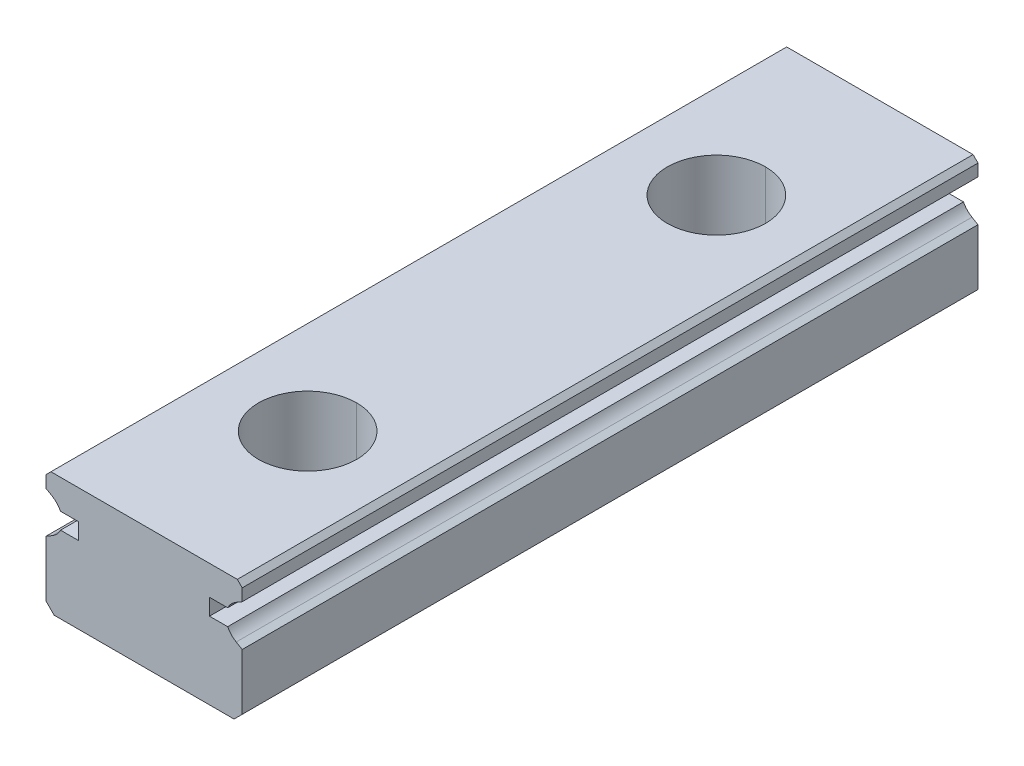
ISO-10303-21;
HEADER;
FILE_DESCRIPTION(('STEP AP214'),'2;1');
FILE_NAME('part.step','',(''),(''),'','','');
FILE_SCHEMA(('AUTOMOTIVE_DESIGN { 1 0 10303 214 1 1 1 1 }'));
ENDSEC;
DATA;
#1=APPLICATION_CONTEXT('core data for automotive mechanical design processes');
#2=APPLICATION_PROTOCOL_DEFINITION('international standard','automotive_design',2000,#1);
#3=PRODUCT_CONTEXT('',#1,'mechanical');
#4=PRODUCT('Part','Part','',(#3));
#5=PRODUCT_RELATED_PRODUCT_CATEGORY('part','',(#4));
#6=PRODUCT_DEFINITION_FORMATION('','',#4);
#7=PRODUCT_DEFINITION_CONTEXT('part definition',#1,'design');
#8=PRODUCT_DEFINITION('design','',#6,#7);
#9=PRODUCT_DEFINITION_SHAPE('','',#8);
#10=(LENGTH_UNIT() NAMED_UNIT(*) SI_UNIT(.MILLI.,.METRE.));
#11=(NAMED_UNIT(*) PLANE_ANGLE_UNIT() SI_UNIT($,.RADIAN.));
#12=(NAMED_UNIT(*) SI_UNIT($,.STERADIAN.) SOLID_ANGLE_UNIT());
#13=UNCERTAINTY_MEASURE_WITH_UNIT(LENGTH_MEASURE(1.E-05),#10,'distance_accuracy_value','');
#14=(GEOMETRIC_REPRESENTATION_CONTEXT(3) GLOBAL_UNCERTAINTY_ASSIGNED_CONTEXT((#13)) GLOBAL_UNIT_ASSIGNED_CONTEXT((#10,
#11,#12)) REPRESENTATION_CONTEXT('',''));
#15=CARTESIAN_POINT('',(0.,0.,0.));
#16=DIRECTION('',(0.,0.,1.));
#17=DIRECTION('',(1.,0.,0.));
#18=AXIS2_PLACEMENT_3D('',#15,#16,#17);
#19=CARTESIAN_POINT('',(5.6315165364224,6.252163080144,22.5));
#20=DIRECTION('',(-0.499987472407115,0.866032636472751,0.));
#21=DIRECTION('',(-0.866032636472751,-0.499987472407115,0.));
#22=AXIS2_PLACEMENT_3D('',#19,#20,#21);
#23=PLANE('',#22);
#24=DIRECTION('',(0.866032636472751,0.499987472407115,0.));
#25=VECTOR('',#24,1.);
#26=CARTESIAN_POINT('',(5.6315165364224,6.252163080144,-22.5));
#27=LINE('',#26,#25);
#28=CARTESIAN_POINT('',(5.6315165364224,6.252163080144,-22.5));
#29=VERTEX_POINT('',#28);
#30=CARTESIAN_POINT('',(6.,6.4649,-22.5));
#31=VERTEX_POINT('',#30);
#32=EDGE_CURVE('E11',#29,#31,#27,.T.);
#33=ORIENTED_EDGE('',*,*,#32,.T.);
#34=DIRECTION('',(0.,0.,-1.));
#35=VECTOR('',#34,1.);
#36=CARTESIAN_POINT('',(6.,6.4649,22.5));
#37=LINE('',#36,#35);
#38=CARTESIAN_POINT('',(6.,6.4649,22.5));
#39=VERTEX_POINT('',#38);
#40=EDGE_CURVE('E25',#39,#31,#37,.T.);
#41=ORIENTED_EDGE('',*,*,#40,.F.);
#42=DIRECTION('',(0.866032636472751,0.499987472407115,0.));
#43=VECTOR('',#42,1.);
#44=CARTESIAN_POINT('',(5.6315165364224,6.252163080144,22.5));
#45=LINE('',#44,#43);
#46=CARTESIAN_POINT('',(5.6315165364224,6.252163080144,22.5));
#47=VERTEX_POINT('',#46);
#48=EDGE_CURVE('E654',#47,#39,#45,.T.);
#49=ORIENTED_EDGE('',*,*,#48,.F.);
#50=DIRECTION('',(0.,0.,-1.));
#51=VECTOR('',#50,1.);
#52=CARTESIAN_POINT('',(5.6315165364224,6.252163080144,22.5));
#53=LINE('',#52,#51);
#54=EDGE_CURVE('E650',#47,#29,#53,.T.);
#55=ORIENTED_EDGE('',*,*,#54,.T.);
#56=EDGE_LOOP('',(#33,#41,#49,#55));
#57=FACE_BOUND('',#56,.T.);
#58=ADVANCED_FACE('F17',(#57),#23,.F.);
#59=CARTESIAN_POINT('',(6.29150000000091,5.10899999999932,22.5));
#60=DIRECTION('',(0.,0.,1.));
#61=DIRECTION('',(0.727779998267332,-0.685810669297294,0.));
#62=AXIS2_PLACEMENT_3D('',#59,#60,#61);
#63=CYLINDRICAL_SURFACE('',#62,1.32);
#64=DIRECTION('',(0.,0.,-1.));
#65=VECTOR('',#64,1.);
#66=CARTESIAN_POINT('',(5.1111953783027,5.7,22.5));
#67=LINE('',#66,#65);
#68=CARTESIAN_POINT('',(5.1111953783027,5.7,22.5));
#69=VERTEX_POINT('',#68);
#70=CARTESIAN_POINT('',(5.1111953783027,5.7,-22.5));
#71=VERTEX_POINT('',#70);
#72=EDGE_CURVE('E646',#69,#71,#67,.T.);
#73=ORIENTED_EDGE('',*,*,#72,.T.);
#74=CARTESIAN_POINT('',(6.29150000000091,5.10899999999932,-22.5));
#75=DIRECTION('',(0.,0.,1.));
#76=DIRECTION('',(1.,0.,0.));
#77=AXIS2_PLACEMENT_3D('',#74,#75,#76);
#78=CIRCLE('',#77,1.32);
#79=EDGE_CURVE('E641',#29,#71,#78,.T.);
#80=ORIENTED_EDGE('',*,*,#79,.F.);
#81=ORIENTED_EDGE('',*,*,#54,.F.);
#82=CARTESIAN_POINT('',(6.29150000000091,5.10899999999932,22.5));
#83=DIRECTION('',(0.,0.,1.));
#84=DIRECTION('',(1.,0.,0.));
#85=AXIS2_PLACEMENT_3D('',#82,#83,#84);
#86=CIRCLE('',#85,1.32);
#87=EDGE_CURVE('E637',#47,#69,#86,.T.);
#88=ORIENTED_EDGE('',*,*,#87,.T.);
#89=EDGE_LOOP('',(#73,#80,#81,#88));
#90=FACE_BOUND('',#89,.T.);
#91=ADVANCED_FACE('F761',(#90),#63,.F.);
#92=CARTESIAN_POINT('',(-6.29150000000005,5.10899999999992,22.5));
#93=DIRECTION('',(0.,0.,1.));
#94=DIRECTION('',(1.,0.,0.));
#95=AXIS2_PLACEMENT_3D('',#92,#93,#94);
#96=PLANE('',#95);
#97=DIRECTION('',(-0.707106781186549,-0.707106781186546,0.));
#98=VECTOR('',#97,1.);
#99=CARTESIAN_POINT('',(-5.7,7.5,22.5));
#100=LINE('',#99,#98);
#101=CARTESIAN_POINT('',(-5.7,7.5,22.5));
#102=VERTEX_POINT('',#101);
#103=CARTESIAN_POINT('',(-6.,7.2,22.5));
#104=VERTEX_POINT('',#103);
#105=EDGE_CURVE('E633',#102,#104,#100,.T.);
#106=ORIENTED_EDGE('',*,*,#105,.T.);
#107=DIRECTION('',(0.,-1.,0.));
#108=VECTOR('',#107,1.);
#109=CARTESIAN_POINT('',(-6.,7.2,22.5));
#110=LINE('',#109,#108);
#111=CARTESIAN_POINT('',(-6.,6.4649,22.5));
#112=VERTEX_POINT('',#111);
#113=EDGE_CURVE('E629',#104,#112,#110,.T.);
#114=ORIENTED_EDGE('',*,*,#113,.T.);
#115=DIRECTION('',(0.866032636472649,-0.499987472407292,0.));
#116=VECTOR('',#115,1.);
#117=CARTESIAN_POINT('',(-6.,6.4649,22.5));
#118=LINE('',#117,#116);
#119=CARTESIAN_POINT('',(-5.6315165364224,6.2521630801439,22.5));
#120=VERTEX_POINT('',#119);
#121=EDGE_CURVE('E625',#112,#120,#118,.T.);
#122=ORIENTED_EDGE('',*,*,#121,.T.);
#123=CARTESIAN_POINT('',(-6.29150000000005,5.10899999999992,22.5));
#124=DIRECTION('',(0.,0.,1.));
#125=DIRECTION('',(1.,0.,0.));
#126=AXIS2_PLACEMENT_3D('',#123,#124,#125);
#127=CIRCLE('',#126,1.32);
#128=CARTESIAN_POINT('',(-5.1111953783027,5.7,22.5));
#129=VERTEX_POINT('',#128);
#130=EDGE_CURVE('E620',#129,#120,#127,.T.);
#131=ORIENTED_EDGE('',*,*,#130,.F.);
#132=DIRECTION('',(1.,0.,0.));
#133=VECTOR('',#132,1.);
#134=CARTESIAN_POINT('',(-5.1111953783027,5.7,22.5));
#135=LINE('',#134,#133);
#136=CARTESIAN_POINT('',(-4.,5.7,22.5));
#137=VERTEX_POINT('',#136);
#138=EDGE_CURVE('E616',#129,#137,#135,.T.);
#139=ORIENTED_EDGE('',*,*,#138,.T.);
#140=DIRECTION('',(0.,-1.,0.));
#141=VECTOR('',#140,1.);
#142=CARTESIAN_POINT('',(-4.,5.7,22.5));
#143=LINE('',#142,#141);
#144=CARTESIAN_POINT('',(-4.,4.7,22.5));
#145=VERTEX_POINT('',#144);
#146=EDGE_CURVE('E612',#137,#145,#143,.T.);
#147=ORIENTED_EDGE('',*,*,#146,.T.);
#148=DIRECTION('',(-1.,0.,0.));
#149=VECTOR('',#148,1.);
#150=CARTESIAN_POINT('',(-4.,4.7,22.5));
#151=LINE('',#150,#149);
#152=CARTESIAN_POINT('',(-5.1111953783027,4.7,22.5));
#153=VERTEX_POINT('',#152);
#154=EDGE_CURVE('E608',#145,#153,#151,.T.);
#155=ORIENTED_EDGE('',*,*,#154,.T.);
#156=CARTESIAN_POINT('',(-6.29150000000005,5.29100000000008,22.5));
#157=DIRECTION('',(0.,0.,1.));
#158=DIRECTION('',(1.,0.,0.));
#159=AXIS2_PLACEMENT_3D('',#156,#157,#158);
#160=CIRCLE('',#159,1.32);
#161=CARTESIAN_POINT('',(-5.6315165364224,4.1478369198561,22.5));
#162=VERTEX_POINT('',#161);
#163=EDGE_CURVE('E603',#162,#153,#160,.T.);
#164=ORIENTED_EDGE('',*,*,#163,.F.);
#165=DIRECTION('',(-0.866032636472649,-0.499987472407292,0.));
#166=VECTOR('',#165,1.);
#167=CARTESIAN_POINT('',(-5.6315165364224,4.1478369198561,22.5));
#168=LINE('',#167,#166);
#169=CARTESIAN_POINT('',(-6.,3.9351,22.5));
#170=VERTEX_POINT('',#169);
#171=EDGE_CURVE('E599',#162,#170,#168,.T.);
#172=ORIENTED_EDGE('',*,*,#171,.T.);
#173=DIRECTION('',(0.,-1.,0.));
#174=VECTOR('',#173,1.);
#175=CARTESIAN_POINT('',(-6.,3.9351,22.5));
#176=LINE('',#175,#174);
#177=CARTESIAN_POINT('',(-6.,0.5,22.5));
#178=VERTEX_POINT('',#177);
#179=EDGE_CURVE('E595',#170,#178,#176,.T.);
#180=ORIENTED_EDGE('',*,*,#179,.T.);
#181=DIRECTION('',(0.707106781186548,-0.707106781186547,0.));
#182=VECTOR('',#181,1.);
#183=CARTESIAN_POINT('',(-6.,0.5,22.5));
#184=LINE('',#183,#182);
#185=CARTESIAN_POINT('',(-5.5,0.,22.5));
#186=VERTEX_POINT('',#185);
#187=EDGE_CURVE('E591',#178,#186,#184,.T.);
#188=ORIENTED_EDGE('',*,*,#187,.T.);
#189=DIRECTION('',(1.,0.,0.));
#190=VECTOR('',#189,1.);
#191=CARTESIAN_POINT('',(-5.5,0.,22.5));
#192=LINE('',#191,#190);
#193=CARTESIAN_POINT('',(5.5,0.,22.5));
#194=VERTEX_POINT('',#193);
#195=EDGE_CURVE('E587',#186,#194,#192,.T.);
#196=ORIENTED_EDGE('',*,*,#195,.T.);
#197=DIRECTION('',(0.707106781186548,0.707106781186547,0.));
#198=VECTOR('',#197,1.);
#199=CARTESIAN_POINT('',(5.5,0.,22.5));
#200=LINE('',#199,#198);
#201=CARTESIAN_POINT('',(6.,0.5,22.5));
#202=VERTEX_POINT('',#201);
#203=EDGE_CURVE('E583',#194,#202,#200,.T.);
#204=ORIENTED_EDGE('',*,*,#203,.T.);
#205=DIRECTION('',(0.,1.,0.));
#206=VECTOR('',#205,1.);
#207=CARTESIAN_POINT('',(6.,0.5,22.5));
#208=LINE('',#207,#206);
#209=CARTESIAN_POINT('',(6.,3.9351,22.5));
#210=VERTEX_POINT('',#209);
#211=EDGE_CURVE('E579',#202,#210,#208,.T.);
#212=ORIENTED_EDGE('',*,*,#211,.T.);
#213=DIRECTION('',(-0.866032636472649,0.499987472407292,0.));
#214=VECTOR('',#213,1.);
#215=CARTESIAN_POINT('',(6.,3.9351,22.5));
#216=LINE('',#215,#214);
#217=CARTESIAN_POINT('',(5.6315165364224,4.1478369198561,22.5));
#218=VERTEX_POINT('',#217);
#219=EDGE_CURVE('E575',#210,#218,#216,.T.);
#220=ORIENTED_EDGE('',*,*,#219,.T.);
#221=CARTESIAN_POINT('',(6.29150000000005,5.29100000000008,22.5));
#222=DIRECTION('',(0.,0.,1.));
#223=DIRECTION('',(1.,0.,0.));
#224=AXIS2_PLACEMENT_3D('',#221,#222,#223);
#225=CIRCLE('',#224,1.32);
#226=CARTESIAN_POINT('',(5.1111953783027,4.7,22.5));
#227=VERTEX_POINT('',#226);
#228=EDGE_CURVE('E570',#227,#218,#225,.T.);
#229=ORIENTED_EDGE('',*,*,#228,.F.);
#230=DIRECTION('',(-1.,0.,0.));
#231=VECTOR('',#230,1.);
#232=CARTESIAN_POINT('',(5.1111953783027,4.7,22.5));
#233=LINE('',#232,#231);
#234=CARTESIAN_POINT('',(4.,4.7,22.5));
#235=VERTEX_POINT('',#234);
#236=EDGE_CURVE('E566',#227,#235,#233,.T.);
#237=ORIENTED_EDGE('',*,*,#236,.T.);
#238=DIRECTION('',(0.,1.,0.));
#239=VECTOR('',#238,1.);
#240=CARTESIAN_POINT('',(4.,4.7,22.5));
#241=LINE('',#240,#239);
#242=CARTESIAN_POINT('',(4.,5.7,22.5));
#243=VERTEX_POINT('',#242);
#244=EDGE_CURVE('E562',#235,#243,#241,.T.);
#245=ORIENTED_EDGE('',*,*,#244,.T.);
#246=DIRECTION('',(1.,0.,0.));
#247=VECTOR('',#246,1.);
#248=CARTESIAN_POINT('',(4.,5.7,22.5));
#249=LINE('',#248,#247);
#250=EDGE_CURVE('E557',#243,#69,#249,.T.);
#251=ORIENTED_EDGE('',*,*,#250,.T.);
#252=ORIENTED_EDGE('',*,*,#87,.F.);
#253=ORIENTED_EDGE('',*,*,#48,.T.);
#254=DIRECTION('',(0.,1.,0.));
#255=VECTOR('',#254,1.);
#256=CARTESIAN_POINT('',(6.,6.4649,22.5));
#257=LINE('',#256,#255);
#258=CARTESIAN_POINT('',(6.,7.2,22.5));
#259=VERTEX_POINT('',#258);
#260=EDGE_CURVE('E553',#39,#259,#257,.T.);
#261=ORIENTED_EDGE('',*,*,#260,.T.);
#262=DIRECTION('',(-0.707106781186549,0.707106781186546,0.));
#263=VECTOR('',#262,1.);
#264=CARTESIAN_POINT('',(6.,7.2,22.5));
#265=LINE('',#264,#263);
#266=CARTESIAN_POINT('',(5.7,7.5,22.5));
#267=VERTEX_POINT('',#266);
#268=EDGE_CURVE('E549',#259,#267,#265,.T.);
#269=ORIENTED_EDGE('',*,*,#268,.T.);
#270=DIRECTION('',(-1.,0.,0.));
#271=VECTOR('',#270,1.);
#272=CARTESIAN_POINT('',(5.7,7.5,22.5));
#273=LINE('',#272,#271);
#274=EDGE_CURVE('E545',#267,#102,#273,.T.);
#275=ORIENTED_EDGE('',*,*,#274,.T.);
#276=EDGE_LOOP('',(#106,#114,#122,#131,#139,#147,#155,#164,#172,#180,#188,#196,#204,#212,#220,
#229,#237,#245,#251,#252,#253,#261,#269,#275));
#277=FACE_BOUND('',#276,.T.);
#278=ADVANCED_FACE('F678',(#277),#96,.T.);
#279=CARTESIAN_POINT('',(5.7,7.5,22.5));
#280=DIRECTION('',(0.,-1.,0.));
#281=DIRECTION('',(0.,0.,-1.));
#282=AXIS2_PLACEMENT_3D('',#279,#280,#281);
#283=PLANE('',#282);
#284=CARTESIAN_POINT('',(0.,7.5,12.5));
#285=DIRECTION('',(0.,-1.,0.));
#286=DIRECTION('',(0.,0.,-1.));
#287=AXIS2_PLACEMENT_3D('',#284,#285,#286);
#288=CIRCLE('',#287,3.);
#289=CARTESIAN_POINT('',(0.,7.5,9.5));
#290=VERTEX_POINT('',#289);
#291=CARTESIAN_POINT('',(0.,7.5,15.5));
#292=VERTEX_POINT('',#291);
#293=EDGE_CURVE('E541',#290,#292,#288,.T.);
#294=ORIENTED_EDGE('',*,*,#293,.T.);
#295=CARTESIAN_POINT('',(0.,7.5,12.5));
#296=DIRECTION('',(0.,-1.,0.));
#297=DIRECTION('',(0.,0.,-1.));
#298=AXIS2_PLACEMENT_3D('',#295,#296,#297);
#299=CIRCLE('',#298,3.);
#300=EDGE_CURVE('E233',#292,#290,#299,.T.);
#301=ORIENTED_EDGE('',*,*,#300,.T.);
#302=EDGE_LOOP('',(#294,#301));
#303=FACE_BOUND('',#302,.T.);
#304=CARTESIAN_POINT('',(0.,7.5,-12.5));
#305=DIRECTION('',(0.,-1.,0.));
#306=DIRECTION('',(0.,0.,-1.));
#307=AXIS2_PLACEMENT_3D('',#304,#305,#306);
#308=CIRCLE('',#307,3.);
#309=CARTESIAN_POINT('',(0.,7.5,-15.5));
#310=VERTEX_POINT('',#309);
#311=CARTESIAN_POINT('',(0.,7.5,-9.5));
#312=VERTEX_POINT('',#311);
#313=EDGE_CURVE('E534',#310,#312,#308,.T.);
#314=ORIENTED_EDGE('',*,*,#313,.T.);
#315=CARTESIAN_POINT('',(0.,7.5,-12.5));
#316=DIRECTION('',(0.,-1.,0.));
#317=DIRECTION('',(0.,0.,-1.));
#318=AXIS2_PLACEMENT_3D('',#315,#316,#317);
#319=CIRCLE('',#318,3.);
#320=EDGE_CURVE('E530',#312,#310,#319,.T.);
#321=ORIENTED_EDGE('',*,*,#320,.T.);
#322=EDGE_LOOP('',(#314,#321));
#323=FACE_BOUND('',#322,.T.);
#324=DIRECTION('',(-1.,0.,0.));
#325=VECTOR('',#324,1.);
#326=CARTESIAN_POINT('',(5.7,7.5,-22.5));
#327=LINE('',#326,#325);
#328=CARTESIAN_POINT('',(5.7,7.5,-22.5));
#329=VERTEX_POINT('',#328);
#330=CARTESIAN_POINT('',(-5.7,7.5,-22.5));
#331=VERTEX_POINT('',#330);
#332=EDGE_CURVE('E526',#329,#331,#327,.T.);
#333=ORIENTED_EDGE('',*,*,#332,.T.);
#334=DIRECTION('',(0.,0.,-1.));
#335=VECTOR('',#334,1.);
#336=CARTESIAN_POINT('',(-5.7,7.5,22.5));
#337=LINE('',#336,#335);
#338=EDGE_CURVE('E521',#102,#331,#337,.T.);
#339=ORIENTED_EDGE('',*,*,#338,.F.);
#340=ORIENTED_EDGE('',*,*,#274,.F.);
#341=DIRECTION('',(0.,0.,-1.));
#342=VECTOR('',#341,1.);
#343=CARTESIAN_POINT('',(5.7,7.5,22.5));
#344=LINE('',#343,#342);
#345=EDGE_CURVE('E517',#267,#329,#344,.T.);
#346=ORIENTED_EDGE('',*,*,#345,.T.);
#347=EDGE_LOOP('',(#333,#339,#340,#346));
#348=FACE_BOUND('',#347,.T.);
#349=ADVANCED_FACE('F681',(#303,#323,#348),#283,.F.);
#350=CARTESIAN_POINT('',(6.,7.2,22.5));
#351=DIRECTION('',(-0.707106781186547,-0.707106781186549,0.));
#352=DIRECTION('',(0.707106781186549,-0.707106781186547,0.));
#353=AXIS2_PLACEMENT_3D('',#350,#351,#352);
#354=PLANE('',#353);
#355=DIRECTION('',(-0.707106781186549,0.707106781186546,0.));
#356=VECTOR('',#355,1.);
#357=CARTESIAN_POINT('',(6.,7.2,-22.5));
#358=LINE('',#357,#356);
#359=CARTESIAN_POINT('',(6.,7.2,-22.5));
#360=VERTEX_POINT('',#359);
#361=EDGE_CURVE('E512',#360,#329,#358,.T.);
#362=ORIENTED_EDGE('',*,*,#361,.T.);
#363=ORIENTED_EDGE('',*,*,#345,.F.);
#364=ORIENTED_EDGE('',*,*,#268,.F.);
#365=DIRECTION('',(0.,0.,-1.));
#366=VECTOR('',#365,1.);
#367=CARTESIAN_POINT('',(6.,7.2,22.5));
#368=LINE('',#367,#366);
#369=EDGE_CURVE('E508',#259,#360,#368,.T.);
#370=ORIENTED_EDGE('',*,*,#369,.T.);
#371=EDGE_LOOP('',(#362,#363,#364,#370));
#372=FACE_BOUND('',#371,.T.);
#373=ADVANCED_FACE('F674',(#372),#354,.F.);
#374=CARTESIAN_POINT('',(6.,6.4649,22.5));
#375=DIRECTION('',(-1.,0.,0.));
#376=DIRECTION('',(0.,0.,1.));
#377=AXIS2_PLACEMENT_3D('',#374,#375,#376);
#378=PLANE('',#377);
#379=DIRECTION('',(0.,1.,0.));
#380=VECTOR('',#379,1.);
#381=CARTESIAN_POINT('',(6.,6.4649,-22.5));
#382=LINE('',#381,#380);
#383=EDGE_CURVE('E503',#31,#360,#382,.T.);
#384=ORIENTED_EDGE('',*,*,#383,.T.);
#385=ORIENTED_EDGE('',*,*,#369,.F.);
#386=ORIENTED_EDGE('',*,*,#260,.F.);
#387=ORIENTED_EDGE('',*,*,#40,.T.);
#388=EDGE_LOOP('',(#384,#385,#386,#387));
#389=FACE_BOUND('',#388,.T.);
#390=ADVANCED_FACE('F665',(#389),#378,.F.);
#391=CARTESIAN_POINT('',(-6.29150000000005,5.10899999999992,-22.5));
#392=DIRECTION('',(0.,0.,1.));
#393=DIRECTION('',(1.,0.,0.));
#394=AXIS2_PLACEMENT_3D('',#391,#392,#393);
#395=PLANE('',#394);
#396=DIRECTION('',(-0.707106781186549,-0.707106781186546,0.));
#397=VECTOR('',#396,1.);
#398=CARTESIAN_POINT('',(-5.7,7.5,-22.5));
#399=LINE('',#398,#397);
#400=CARTESIAN_POINT('',(-6.,7.2,-22.5));
#401=VERTEX_POINT('',#400);
#402=EDGE_CURVE('E498',#331,#401,#399,.T.);
#403=ORIENTED_EDGE('',*,*,#402,.F.);
#404=ORIENTED_EDGE('',*,*,#332,.F.);
#405=ORIENTED_EDGE('',*,*,#361,.F.);
#406=ORIENTED_EDGE('',*,*,#383,.F.);
#407=ORIENTED_EDGE('',*,*,#32,.F.);
#408=ORIENTED_EDGE('',*,*,#79,.T.);
#409=DIRECTION('',(1.,0.,0.));
#410=VECTOR('',#409,1.);
#411=CARTESIAN_POINT('',(4.,5.7,-22.5));
#412=LINE('',#411,#410);
#413=CARTESIAN_POINT('',(4.,5.7,-22.5));
#414=VERTEX_POINT('',#413);
#415=EDGE_CURVE('E493',#414,#71,#412,.T.);
#416=ORIENTED_EDGE('',*,*,#415,.F.);
#417=DIRECTION('',(0.,1.,0.));
#418=VECTOR('',#417,1.);
#419=CARTESIAN_POINT('',(4.,4.7,-22.5));
#420=LINE('',#419,#418);
#421=CARTESIAN_POINT('',(4.,4.7,-22.5));
#422=VERTEX_POINT('',#421);
#423=EDGE_CURVE('E488',#422,#414,#420,.T.);
#424=ORIENTED_EDGE('',*,*,#423,.F.);
#425=DIRECTION('',(-1.,0.,0.));
#426=VECTOR('',#425,1.);
#427=CARTESIAN_POINT('',(5.1111953783027,4.7,-22.5));
#428=LINE('',#427,#426);
#429=CARTESIAN_POINT('',(5.1111953783027,4.7,-22.5));
#430=VERTEX_POINT('',#429);
#431=EDGE_CURVE('E483',#430,#422,#428,.T.);
#432=ORIENTED_EDGE('',*,*,#431,.F.);
#433=CARTESIAN_POINT('',(6.29150000000005,5.29100000000008,-22.5));
#434=DIRECTION('',(0.,0.,1.));
#435=DIRECTION('',(1.,0.,0.));
#436=AXIS2_PLACEMENT_3D('',#433,#434,#435);
#437=CIRCLE('',#436,1.32);
#438=CARTESIAN_POINT('',(5.6315165364224,4.1478369198561,-22.5));
#439=VERTEX_POINT('',#438);
#440=EDGE_CURVE('E479',#430,#439,#437,.T.);
#441=ORIENTED_EDGE('',*,*,#440,.T.);
#442=DIRECTION('',(-0.866032636472649,0.499987472407292,0.));
#443=VECTOR('',#442,1.);
#444=CARTESIAN_POINT('',(6.,3.9351,-22.5));
#445=LINE('',#444,#443);
#446=CARTESIAN_POINT('',(6.,3.9351,-22.5));
#447=VERTEX_POINT('',#446);
#448=EDGE_CURVE('E474',#447,#439,#445,.T.);
#449=ORIENTED_EDGE('',*,*,#448,.F.);
#450=DIRECTION('',(0.,1.,0.));
#451=VECTOR('',#450,1.);
#452=CARTESIAN_POINT('',(6.,0.5,-22.5));
#453=LINE('',#452,#451);
#454=CARTESIAN_POINT('',(6.,0.5,-22.5));
#455=VERTEX_POINT('',#454);
#456=EDGE_CURVE('E469',#455,#447,#453,.T.);
#457=ORIENTED_EDGE('',*,*,#456,.F.);
#458=DIRECTION('',(0.707106781186548,0.707106781186547,0.));
#459=VECTOR('',#458,1.);
#460=CARTESIAN_POINT('',(5.5,0.,-22.5));
#461=LINE('',#460,#459);
#462=CARTESIAN_POINT('',(5.5,0.,-22.5));
#463=VERTEX_POINT('',#462);
#464=EDGE_CURVE('E464',#463,#455,#461,.T.);
#465=ORIENTED_EDGE('',*,*,#464,.F.);
#466=DIRECTION('',(1.,0.,0.));
#467=VECTOR('',#466,1.);
#468=CARTESIAN_POINT('',(-5.5,0.,-22.5));
#469=LINE('',#468,#467);
#470=CARTESIAN_POINT('',(-5.5,0.,-22.5));
#471=VERTEX_POINT('',#470);
#472=EDGE_CURVE('E459',#471,#463,#469,.T.);
#473=ORIENTED_EDGE('',*,*,#472,.F.);
#474=DIRECTION('',(0.707106781186548,-0.707106781186547,0.));
#475=VECTOR('',#474,1.);
#476=CARTESIAN_POINT('',(-6.,0.5,-22.5));
#477=LINE('',#476,#475);
#478=CARTESIAN_POINT('',(-6.,0.5,-22.5));
#479=VERTEX_POINT('',#478);
#480=EDGE_CURVE('E454',#479,#471,#477,.T.);
#481=ORIENTED_EDGE('',*,*,#480,.F.);
#482=DIRECTION('',(0.,-1.,0.));
#483=VECTOR('',#482,1.);
#484=CARTESIAN_POINT('',(-6.,3.9351,-22.5));
#485=LINE('',#484,#483);
#486=CARTESIAN_POINT('',(-6.,3.9351,-22.5));
#487=VERTEX_POINT('',#486);
#488=EDGE_CURVE('E449',#487,#479,#485,.T.);
#489=ORIENTED_EDGE('',*,*,#488,.F.);
#490=DIRECTION('',(-0.866032636472649,-0.499987472407292,0.));
#491=VECTOR('',#490,1.);
#492=CARTESIAN_POINT('',(-5.6315165364224,4.1478369198561,-22.5));
#493=LINE('',#492,#491);
#494=CARTESIAN_POINT('',(-5.6315165364224,4.1478369198561,-22.5));
#495=VERTEX_POINT('',#494);
#496=EDGE_CURVE('E444',#495,#487,#493,.T.);
#497=ORIENTED_EDGE('',*,*,#496,.F.);
#498=CARTESIAN_POINT('',(-6.29150000000005,5.29100000000008,-22.5));
#499=DIRECTION('',(0.,0.,1.));
#500=DIRECTION('',(1.,0.,0.));
#501=AXIS2_PLACEMENT_3D('',#498,#499,#500);
#502=CIRCLE('',#501,1.32);
#503=CARTESIAN_POINT('',(-5.1111953783027,4.7,-22.5));
#504=VERTEX_POINT('',#503);
#505=EDGE_CURVE('E440',#495,#504,#502,.T.);
#506=ORIENTED_EDGE('',*,*,#505,.T.);
#507=DIRECTION('',(-1.,0.,0.));
#508=VECTOR('',#507,1.);
#509=CARTESIAN_POINT('',(-4.,4.7,-22.5));
#510=LINE('',#509,#508);
#511=CARTESIAN_POINT('',(-4.,4.7,-22.5));
#512=VERTEX_POINT('',#511);
#513=EDGE_CURVE('E435',#512,#504,#510,.T.);
#514=ORIENTED_EDGE('',*,*,#513,.F.);
#515=DIRECTION('',(0.,-1.,0.));
#516=VECTOR('',#515,1.);
#517=CARTESIAN_POINT('',(-4.,5.7,-22.5));
#518=LINE('',#517,#516);
#519=CARTESIAN_POINT('',(-4.,5.7,-22.5));
#520=VERTEX_POINT('',#519);
#521=EDGE_CURVE('E430',#520,#512,#518,.T.);
#522=ORIENTED_EDGE('',*,*,#521,.F.);
#523=DIRECTION('',(1.,0.,0.));
#524=VECTOR('',#523,1.);
#525=CARTESIAN_POINT('',(-5.1111953783027,5.7,-22.5));
#526=LINE('',#525,#524);
#527=CARTESIAN_POINT('',(-5.1111953783027,5.7,-22.5));
#528=VERTEX_POINT('',#527);
#529=EDGE_CURVE('E425',#528,#520,#526,.T.);
#530=ORIENTED_EDGE('',*,*,#529,.F.);
#531=CARTESIAN_POINT('',(-6.29150000000005,5.10899999999992,-22.5));
#532=DIRECTION('',(0.,0.,1.));
#533=DIRECTION('',(1.,0.,0.));
#534=AXIS2_PLACEMENT_3D('',#531,#532,#533);
#535=CIRCLE('',#534,1.32);
#536=CARTESIAN_POINT('',(-5.6315165364224,6.2521630801439,-22.5));
#537=VERTEX_POINT('',#536);
#538=EDGE_CURVE('E421',#528,#537,#535,.T.);
#539=ORIENTED_EDGE('',*,*,#538,.T.);
#540=DIRECTION('',(0.866032636472649,-0.499987472407292,0.));
#541=VECTOR('',#540,1.);
#542=CARTESIAN_POINT('',(-6.,6.4649,-22.5));
#543=LINE('',#542,#541);
#544=CARTESIAN_POINT('',(-6.,6.4649,-22.5));
#545=VERTEX_POINT('',#544);
#546=EDGE_CURVE('E416',#545,#537,#543,.T.);
#547=ORIENTED_EDGE('',*,*,#546,.F.);
#548=DIRECTION('',(0.,-1.,0.));
#549=VECTOR('',#548,1.);
#550=CARTESIAN_POINT('',(-6.,7.2,-22.5));
#551=LINE('',#550,#549);
#552=EDGE_CURVE('E411',#401,#545,#551,.T.);
#553=ORIENTED_EDGE('',*,*,#552,.F.);
#554=EDGE_LOOP('',(#403,#404,#405,#406,#407,#408,#416,#424,#432,#441,#449,#457,#465,#473,#481,
#489,#497,#506,#514,#522,#530,#539,#547,#553));
#555=FACE_BOUND('',#554,.T.);
#556=ADVANCED_FACE('F670',(#555),#395,.F.);
#557=CARTESIAN_POINT('',(-6.,7.2,22.5));
#558=DIRECTION('',(1.,0.,0.));
#559=DIRECTION('',(0.,0.,-1.));
#560=AXIS2_PLACEMENT_3D('',#557,#558,#559);
#561=PLANE('',#560);
#562=ORIENTED_EDGE('',*,*,#552,.T.);
#563=DIRECTION('',(0.,0.,-1.));
#564=VECTOR('',#563,1.);
#565=CARTESIAN_POINT('',(-6.,6.4649,22.5));
#566=LINE('',#565,#564);
#567=EDGE_CURVE('E406',#112,#545,#566,.T.);
#568=ORIENTED_EDGE('',*,*,#567,.F.);
#569=ORIENTED_EDGE('',*,*,#113,.F.);
#570=DIRECTION('',(0.,0.,-1.));
#571=VECTOR('',#570,1.);
#572=CARTESIAN_POINT('',(-6.,7.2,22.5));
#573=LINE('',#572,#571);
#574=EDGE_CURVE('E401',#104,#401,#573,.T.);
#575=ORIENTED_EDGE('',*,*,#574,.T.);
#576=EDGE_LOOP('',(#562,#568,#569,#575));
#577=FACE_BOUND('',#576,.T.);
#578=ADVANCED_FACE('F689',(#577),#561,.F.);
#579=CARTESIAN_POINT('',(-5.7,7.5,22.5));
#580=DIRECTION('',(0.707106781186547,-0.707106781186549,0.));
#581=DIRECTION('',(0.707106781186549,0.707106781186547,0.));
#582=AXIS2_PLACEMENT_3D('',#579,#580,#581);
#583=PLANE('',#582);
#584=ORIENTED_EDGE('',*,*,#402,.T.);
#585=ORIENTED_EDGE('',*,*,#574,.F.);
#586=ORIENTED_EDGE('',*,*,#105,.F.);
#587=ORIENTED_EDGE('',*,*,#338,.T.);
#588=EDGE_LOOP('',(#584,#585,#586,#587));
#589=FACE_BOUND('',#588,.T.);
#590=ADVANCED_FACE('F685',(#589),#583,.F.);
#591=CARTESIAN_POINT('',(-6.,6.4649,22.5));
#592=DIRECTION('',(0.499987472407292,0.866032636472649,0.));
#593=DIRECTION('',(-0.866032636472649,0.499987472407292,0.));
#594=AXIS2_PLACEMENT_3D('',#591,#592,#593);
#595=PLANE('',#594);
#596=ORIENTED_EDGE('',*,*,#546,.T.);
#597=DIRECTION('',(0.,0.,-1.));
#598=VECTOR('',#597,1.);
#599=CARTESIAN_POINT('',(-5.6315165364224,6.2521630801439,22.5));
#600=LINE('',#599,#598);
#601=EDGE_CURVE('E396',#120,#537,#600,.T.);
#602=ORIENTED_EDGE('',*,*,#601,.F.);
#603=ORIENTED_EDGE('',*,*,#121,.F.);
#604=ORIENTED_EDGE('',*,*,#567,.T.);
#605=EDGE_LOOP('',(#596,#602,#603,#604));
#606=FACE_BOUND('',#605,.T.);
#607=ADVANCED_FACE('F693',(#606),#595,.F.);
#608=CARTESIAN_POINT('',(-6.29150000000005,5.10899999999992,22.5));
#609=DIRECTION('',(0.,0.,1.));
#610=DIRECTION('',(-0.727779998267269,-0.68581066929736,0.));
#611=AXIS2_PLACEMENT_3D('',#608,#609,#610);
#612=CYLINDRICAL_SURFACE('',#611,1.32);
#613=ORIENTED_EDGE('',*,*,#601,.T.);
#614=ORIENTED_EDGE('',*,*,#538,.F.);
#615=DIRECTION('',(0.,0.,-1.));
#616=VECTOR('',#615,1.);
#617=CARTESIAN_POINT('',(-5.1111953783027,5.7,22.5));
#618=LINE('',#617,#616);
#619=EDGE_CURVE('E391',#129,#528,#618,.T.);
#620=ORIENTED_EDGE('',*,*,#619,.F.);
#621=ORIENTED_EDGE('',*,*,#130,.T.);
#622=EDGE_LOOP('',(#613,#614,#620,#621));
#623=FACE_BOUND('',#622,.T.);
#624=ADVANCED_FACE('F699',(#623),#612,.F.);
#625=CARTESIAN_POINT('',(-5.1111953783027,5.7,22.5));
#626=DIRECTION('',(0.,1.,0.));
#627=DIRECTION('',(0.,0.,1.));
#628=AXIS2_PLACEMENT_3D('',#625,#626,#627);
#629=PLANE('',#628);
#630=ORIENTED_EDGE('',*,*,#529,.T.);
#631=DIRECTION('',(0.,0.,-1.));
#632=VECTOR('',#631,1.);
#633=CARTESIAN_POINT('',(-4.,5.7,22.5));
#634=LINE('',#633,#632);
#635=EDGE_CURVE('E386',#137,#520,#634,.T.);
#636=ORIENTED_EDGE('',*,*,#635,.F.);
#637=ORIENTED_EDGE('',*,*,#138,.F.);
#638=ORIENTED_EDGE('',*,*,#619,.T.);
#639=EDGE_LOOP('',(#630,#636,#637,#638));
#640=FACE_BOUND('',#639,.T.);
#641=ADVANCED_FACE('F701',(#640),#629,.F.);
#642=CARTESIAN_POINT('',(-4.,5.7,22.5));
#643=DIRECTION('',(1.,0.,0.));
#644=DIRECTION('',(0.,0.,-1.));
#645=AXIS2_PLACEMENT_3D('',#642,#643,#644);
#646=PLANE('',#645);
#647=ORIENTED_EDGE('',*,*,#521,.T.);
#648=DIRECTION('',(0.,0.,-1.));
#649=VECTOR('',#648,1.);
#650=CARTESIAN_POINT('',(-4.,4.7,22.5));
#651=LINE('',#650,#649);
#652=EDGE_CURVE('E381',#145,#512,#651,.T.);
#653=ORIENTED_EDGE('',*,*,#652,.F.);
#654=ORIENTED_EDGE('',*,*,#146,.F.);
#655=ORIENTED_EDGE('',*,*,#635,.T.);
#656=EDGE_LOOP('',(#647,#653,#654,#655));
#657=FACE_BOUND('',#656,.T.);
#658=ADVANCED_FACE('F705',(#657),#646,.F.);
#659=CARTESIAN_POINT('',(-4.,4.7,22.5));
#660=DIRECTION('',(0.,-1.,0.));
#661=DIRECTION('',(0.,0.,-1.));
#662=AXIS2_PLACEMENT_3D('',#659,#660,#661);
#663=PLANE('',#662);
#664=ORIENTED_EDGE('',*,*,#513,.T.);
#665=DIRECTION('',(0.,0.,-1.));
#666=VECTOR('',#665,1.);
#667=CARTESIAN_POINT('',(-5.1111953783027,4.7,22.5));
#668=LINE('',#667,#666);
#669=EDGE_CURVE('E376',#153,#504,#668,.T.);
#670=ORIENTED_EDGE('',*,*,#669,.F.);
#671=ORIENTED_EDGE('',*,*,#154,.F.);
#672=ORIENTED_EDGE('',*,*,#652,.T.);
#673=EDGE_LOOP('',(#664,#670,#671,#672));
#674=FACE_BOUND('',#673,.T.);
#675=ADVANCED_FACE('F710',(#674),#663,.F.);
#676=CARTESIAN_POINT('',(-6.29150000000005,5.29100000000008,22.5));
#677=DIRECTION('',(0.,0.,1.));
#678=DIRECTION('',(-0.727779998267269,0.685810669297361,0.));
#679=AXIS2_PLACEMENT_3D('',#676,#677,#678);
#680=CYLINDRICAL_SURFACE('',#679,1.32);
#681=ORIENTED_EDGE('',*,*,#669,.T.);
#682=ORIENTED_EDGE('',*,*,#505,.F.);
#683=DIRECTION('',(0.,0.,-1.));
#684=VECTOR('',#683,1.);
#685=CARTESIAN_POINT('',(-5.6315165364224,4.1478369198561,22.5));
#686=LINE('',#685,#684);
#687=EDGE_CURVE('E371',#162,#495,#686,.T.);
#688=ORIENTED_EDGE('',*,*,#687,.F.);
#689=ORIENTED_EDGE('',*,*,#163,.T.);
#690=EDGE_LOOP('',(#681,#682,#688,#689));
#691=FACE_BOUND('',#690,.T.);
#692=ADVANCED_FACE('F713',(#691),#680,.F.);
#693=CARTESIAN_POINT('',(-5.6315165364224,4.1478369198561,22.5));
#694=DIRECTION('',(0.499987472407292,-0.866032636472649,0.));
#695=DIRECTION('',(0.866032636472649,0.499987472407292,0.));
#696=AXIS2_PLACEMENT_3D('',#693,#694,#695);
#697=PLANE('',#696);
#698=ORIENTED_EDGE('',*,*,#496,.T.);
#699=DIRECTION('',(0.,0.,-1.));
#700=VECTOR('',#699,1.);
#701=CARTESIAN_POINT('',(-6.,3.9351,22.5));
#702=LINE('',#701,#700);
#703=EDGE_CURVE('E366',#170,#487,#702,.T.);
#704=ORIENTED_EDGE('',*,*,#703,.F.);
#705=ORIENTED_EDGE('',*,*,#171,.F.);
#706=ORIENTED_EDGE('',*,*,#687,.T.);
#707=EDGE_LOOP('',(#698,#704,#705,#706));
#708=FACE_BOUND('',#707,.T.);
#709=ADVANCED_FACE('F717',(#708),#697,.F.);
#710=CARTESIAN_POINT('',(-6.,3.9351,22.5));
#711=DIRECTION('',(1.,0.,0.));
#712=DIRECTION('',(0.,0.,-1.));
#713=AXIS2_PLACEMENT_3D('',#710,#711,#712);
#714=PLANE('',#713);
#715=ORIENTED_EDGE('',*,*,#488,.T.);
#716=DIRECTION('',(0.,0.,-1.));
#717=VECTOR('',#716,1.);
#718=CARTESIAN_POINT('',(-6.,0.5,22.5));
#719=LINE('',#718,#717);
#720=EDGE_CURVE('E361',#178,#479,#719,.T.);
#721=ORIENTED_EDGE('',*,*,#720,.F.);
#722=ORIENTED_EDGE('',*,*,#179,.F.);
#723=ORIENTED_EDGE('',*,*,#703,.T.);
#724=EDGE_LOOP('',(#715,#721,#722,#723));
#725=FACE_BOUND('',#724,.T.);
#726=ADVANCED_FACE('F723',(#725),#714,.F.);
#727=CARTESIAN_POINT('',(-6.,0.5,22.5));
#728=DIRECTION('',(0.707106781186547,0.707106781186548,0.));
#729=DIRECTION('',(-0.707106781186548,0.707106781186547,0.));
#730=AXIS2_PLACEMENT_3D('',#727,#728,#729);
#731=PLANE('',#730);
#732=ORIENTED_EDGE('',*,*,#480,.T.);
#733=DIRECTION('',(0.,0.,-1.));
#734=VECTOR('',#733,1.);
#735=CARTESIAN_POINT('',(-5.5,0.,22.5));
#736=LINE('',#735,#734);
#737=EDGE_CURVE('E356',#186,#471,#736,.T.);
#738=ORIENTED_EDGE('',*,*,#737,.F.);
#739=ORIENTED_EDGE('',*,*,#187,.F.);
#740=ORIENTED_EDGE('',*,*,#720,.T.);
#741=EDGE_LOOP('',(#732,#738,#739,#740));
#742=FACE_BOUND('',#741,.T.);
#743=ADVANCED_FACE('F725',(#742),#731,.F.);
#744=CARTESIAN_POINT('',(-5.5,0.,22.5));
#745=DIRECTION('',(0.,1.,0.));
#746=DIRECTION('',(0.,0.,1.));
#747=AXIS2_PLACEMENT_3D('',#744,#745,#746);
#748=PLANE('',#747);
#749=CARTESIAN_POINT('',(0.,0.,12.5));
#750=DIRECTION('',(0.,-1.,0.));
#751=DIRECTION('',(0.,0.,-1.));
#752=AXIS2_PLACEMENT_3D('',#749,#750,#751);
#753=CIRCLE('',#752,1.75);
#754=CARTESIAN_POINT('',(0.,0.,10.75));
#755=VERTEX_POINT('',#754);
#756=CARTESIAN_POINT('',(0.,0.,14.25));
#757=VERTEX_POINT('',#756);
#758=EDGE_CURVE('E351',#755,#757,#753,.T.);
#759=ORIENTED_EDGE('',*,*,#758,.F.);
#760=CARTESIAN_POINT('',(0.,0.,12.5));
#761=DIRECTION('',(0.,-1.,0.));
#762=DIRECTION('',(0.,0.,-1.));
#763=AXIS2_PLACEMENT_3D('',#760,#761,#762);
#764=CIRCLE('',#763,1.75);
#765=EDGE_CURVE('E346',#757,#755,#764,.T.);
#766=ORIENTED_EDGE('',*,*,#765,.F.);
#767=EDGE_LOOP('',(#759,#766));
#768=FACE_BOUND('',#767,.T.);
#769=CARTESIAN_POINT('',(0.,0.,-12.5));
#770=DIRECTION('',(0.,-1.,0.));
#771=DIRECTION('',(0.,0.,-1.));
#772=AXIS2_PLACEMENT_3D('',#769,#770,#771);
#773=CIRCLE('',#772,1.75);
#774=CARTESIAN_POINT('',(0.,0.,-14.25));
#775=VERTEX_POINT('',#774);
#776=CARTESIAN_POINT('',(0.,0.,-10.75));
#777=VERTEX_POINT('',#776);
#778=EDGE_CURVE('E341',#775,#777,#773,.T.);
#779=ORIENTED_EDGE('',*,*,#778,.F.);
#780=CARTESIAN_POINT('',(0.,0.,-12.5));
#781=DIRECTION('',(0.,-1.,0.));
#782=DIRECTION('',(0.,0.,-1.));
#783=AXIS2_PLACEMENT_3D('',#780,#781,#782);
#784=CIRCLE('',#783,1.75);
#785=EDGE_CURVE('E336',#777,#775,#784,.T.);
#786=ORIENTED_EDGE('',*,*,#785,.F.);
#787=EDGE_LOOP('',(#779,#786));
#788=FACE_BOUND('',#787,.T.);
#789=ORIENTED_EDGE('',*,*,#472,.T.);
#790=DIRECTION('',(0.,0.,-1.));
#791=VECTOR('',#790,1.);
#792=CARTESIAN_POINT('',(5.5,0.,22.5));
#793=LINE('',#792,#791);
#794=EDGE_CURVE('E331',#194,#463,#793,.T.);
#795=ORIENTED_EDGE('',*,*,#794,.F.);
#796=ORIENTED_EDGE('',*,*,#195,.F.);
#797=ORIENTED_EDGE('',*,*,#737,.T.);
#798=EDGE_LOOP('',(#789,#795,#796,#797));
#799=FACE_BOUND('',#798,.T.);
#800=ADVANCED_FACE('F729',(#768,#788,#799),#748,.F.);
#801=CARTESIAN_POINT('',(5.5,0.,22.5));
#802=DIRECTION('',(-0.707106781186547,0.707106781186548,0.));
#803=DIRECTION('',(-0.707106781186548,-0.707106781186547,0.));
#804=AXIS2_PLACEMENT_3D('',#801,#802,#803);
#805=PLANE('',#804);
#806=ORIENTED_EDGE('',*,*,#464,.T.);
#807=DIRECTION('',(0.,0.,-1.));
#808=VECTOR('',#807,1.);
#809=CARTESIAN_POINT('',(6.,0.5,22.5));
#810=LINE('',#809,#808);
#811=EDGE_CURVE('E326',#202,#455,#810,.T.);
#812=ORIENTED_EDGE('',*,*,#811,.F.);
#813=ORIENTED_EDGE('',*,*,#203,.F.);
#814=ORIENTED_EDGE('',*,*,#794,.T.);
#815=EDGE_LOOP('',(#806,#812,#813,#814));
#816=FACE_BOUND('',#815,.T.);
#817=ADVANCED_FACE('F735',(#816),#805,.F.);
#818=CARTESIAN_POINT('',(6.,0.5,22.5));
#819=DIRECTION('',(-1.,0.,0.));
#820=DIRECTION('',(0.,0.,1.));
#821=AXIS2_PLACEMENT_3D('',#818,#819,#820);
#822=PLANE('',#821);
#823=ORIENTED_EDGE('',*,*,#456,.T.);
#824=DIRECTION('',(0.,0.,-1.));
#825=VECTOR('',#824,1.);
#826=CARTESIAN_POINT('',(6.,3.9351,22.5));
#827=LINE('',#826,#825);
#828=EDGE_CURVE('E321',#210,#447,#827,.T.);
#829=ORIENTED_EDGE('',*,*,#828,.F.);
#830=ORIENTED_EDGE('',*,*,#211,.F.);
#831=ORIENTED_EDGE('',*,*,#811,.T.);
#832=EDGE_LOOP('',(#823,#829,#830,#831));
#833=FACE_BOUND('',#832,.T.);
#834=ADVANCED_FACE('F737',(#833),#822,.F.);
#835=CARTESIAN_POINT('',(6.,3.9351,22.5));
#836=DIRECTION('',(-0.499987472407292,-0.866032636472649,0.));
#837=DIRECTION('',(0.866032636472649,-0.499987472407292,0.));
#838=AXIS2_PLACEMENT_3D('',#835,#836,#837);
#839=PLANE('',#838);
#840=ORIENTED_EDGE('',*,*,#448,.T.);
#841=DIRECTION('',(0.,0.,-1.));
#842=VECTOR('',#841,1.);
#843=CARTESIAN_POINT('',(5.6315165364224,4.1478369198561,22.5));
#844=LINE('',#843,#842);
#845=EDGE_CURVE('E316',#218,#439,#844,.T.);
#846=ORIENTED_EDGE('',*,*,#845,.F.);
#847=ORIENTED_EDGE('',*,*,#219,.F.);
#848=ORIENTED_EDGE('',*,*,#828,.T.);
#849=EDGE_LOOP('',(#840,#846,#847,#848));
#850=FACE_BOUND('',#849,.T.);
#851=ADVANCED_FACE('F741',(#850),#839,.F.);
#852=CARTESIAN_POINT('',(6.29150000000005,5.29100000000008,22.5));
#853=DIRECTION('',(0.,0.,1.));
#854=DIRECTION('',(0.727779998267269,0.685810669297361,0.));
#855=AXIS2_PLACEMENT_3D('',#852,#853,#854);
#856=CYLINDRICAL_SURFACE('',#855,1.32);
#857=ORIENTED_EDGE('',*,*,#845,.T.);
#858=ORIENTED_EDGE('',*,*,#440,.F.);
#859=DIRECTION('',(0.,0.,-1.));
#860=VECTOR('',#859,1.);
#861=CARTESIAN_POINT('',(5.1111953783027,4.7,22.5));
#862=LINE('',#861,#860);
#863=EDGE_CURVE('E311',#227,#430,#862,.T.);
#864=ORIENTED_EDGE('',*,*,#863,.F.);
#865=ORIENTED_EDGE('',*,*,#228,.T.);
#866=EDGE_LOOP('',(#857,#858,#864,#865));
#867=FACE_BOUND('',#866,.T.);
#868=ADVANCED_FACE('F747',(#867),#856,.F.);
#869=CARTESIAN_POINT('',(5.1111953783027,4.7,22.5));
#870=DIRECTION('',(0.,-1.,0.));
#871=DIRECTION('',(0.,0.,-1.));
#872=AXIS2_PLACEMENT_3D('',#869,#870,#871);
#873=PLANE('',#872);
#874=ORIENTED_EDGE('',*,*,#431,.T.);
#875=DIRECTION('',(0.,0.,-1.));
#876=VECTOR('',#875,1.);
#877=CARTESIAN_POINT('',(4.,4.7,22.5));
#878=LINE('',#877,#876);
#879=EDGE_CURVE('E306',#235,#422,#878,.T.);
#880=ORIENTED_EDGE('',*,*,#879,.F.);
#881=ORIENTED_EDGE('',*,*,#236,.F.);
#882=ORIENTED_EDGE('',*,*,#863,.T.);
#883=EDGE_LOOP('',(#874,#880,#881,#882));
#884=FACE_BOUND('',#883,.T.);
#885=ADVANCED_FACE('F749',(#884),#873,.F.);
#886=CARTESIAN_POINT('',(4.,4.7,22.5));
#887=DIRECTION('',(-1.,0.,0.));
#888=DIRECTION('',(0.,0.,1.));
#889=AXIS2_PLACEMENT_3D('',#886,#887,#888);
#890=PLANE('',#889);
#891=ORIENTED_EDGE('',*,*,#423,.T.);
#892=DIRECTION('',(0.,0.,-1.));
#893=VECTOR('',#892,1.);
#894=CARTESIAN_POINT('',(4.,5.7,22.5));
#895=LINE('',#894,#893);
#896=EDGE_CURVE('E301',#243,#414,#895,.T.);
#897=ORIENTED_EDGE('',*,*,#896,.F.);
#898=ORIENTED_EDGE('',*,*,#244,.F.);
#899=ORIENTED_EDGE('',*,*,#879,.T.);
#900=EDGE_LOOP('',(#891,#897,#898,#899));
#901=FACE_BOUND('',#900,.T.);
#902=ADVANCED_FACE('F753',(#901),#890,.F.);
#903=CARTESIAN_POINT('',(4.,5.7,22.5));
#904=DIRECTION('',(0.,1.,0.));
#905=DIRECTION('',(0.,0.,1.));
#906=AXIS2_PLACEMENT_3D('',#903,#904,#905);
#907=PLANE('',#906);
#908=ORIENTED_EDGE('',*,*,#415,.T.);
#909=ORIENTED_EDGE('',*,*,#72,.F.);
#910=ORIENTED_EDGE('',*,*,#250,.F.);
#911=ORIENTED_EDGE('',*,*,#896,.T.);
#912=EDGE_LOOP('',(#908,#909,#910,#911));
#913=FACE_BOUND('',#912,.T.);
#914=ADVANCED_FACE('F758',(#913),#907,.F.);
#915=CARTESIAN_POINT('',(0.,0.,-12.5));
#916=DIRECTION('',(0.,1.,0.));
#917=DIRECTION('',(1.,0.,0.));
#918=AXIS2_PLACEMENT_3D('',#915,#916,#917);
#919=CYLINDRICAL_SURFACE('',#918,1.75);
#920=CARTESIAN_POINT('',(0.,3.,-12.5));
#921=DIRECTION('',(0.,-1.,0.));
#922=DIRECTION('',(0.,0.,-1.));
#923=AXIS2_PLACEMENT_3D('',#920,#921,#922);
#924=CIRCLE('',#923,1.75);
#925=CARTESIAN_POINT('',(0.,3.,-10.75));
#926=VERTEX_POINT('',#925);
#927=CARTESIAN_POINT('',(0.,3.,-14.25));
#928=VERTEX_POINT('',#927);
#929=EDGE_CURVE('E296',#926,#928,#924,.T.);
#930=ORIENTED_EDGE('',*,*,#929,.F.);
#931=DIRECTION('',(0.,1.,0.));
#932=VECTOR('',#931,1.);
#933=CARTESIAN_POINT('',(0.,0.,-10.75));
#934=LINE('',#933,#932);
#935=EDGE_CURVE('E291',#777,#926,#934,.T.);
#936=ORIENTED_EDGE('',*,*,#935,.F.);
#937=ORIENTED_EDGE('',*,*,#785,.T.);
#938=DIRECTION('',(0.,1.,0.));
#939=VECTOR('',#938,1.);
#940=CARTESIAN_POINT('',(0.,0.,-14.25));
#941=LINE('',#940,#939);
#942=EDGE_CURVE('E287',#775,#928,#941,.T.);
#943=ORIENTED_EDGE('',*,*,#942,.T.);
#944=EDGE_LOOP('',(#930,#936,#937,#943));
#945=FACE_BOUND('',#944,.T.);
#946=ADVANCED_FACE('F821',(#945),#919,.F.);
#947=CARTESIAN_POINT('',(0.,0.,-12.5));
#948=DIRECTION('',(0.,1.,0.));
#949=DIRECTION('',(-1.,0.,0.));
#950=AXIS2_PLACEMENT_3D('',#947,#948,#949);
#951=CYLINDRICAL_SURFACE('',#950,1.75);
#952=ORIENTED_EDGE('',*,*,#778,.T.);
#953=ORIENTED_EDGE('',*,*,#935,.T.);
#954=CARTESIAN_POINT('',(0.,3.,-12.5));
#955=DIRECTION('',(0.,-1.,0.));
#956=DIRECTION('',(0.,0.,-1.));
#957=AXIS2_PLACEMENT_3D('',#954,#955,#956);
#958=CIRCLE('',#957,1.75);
#959=EDGE_CURVE('E282',#928,#926,#958,.T.);
#960=ORIENTED_EDGE('',*,*,#959,.F.);
#961=ORIENTED_EDGE('',*,*,#942,.F.);
#962=EDGE_LOOP('',(#952,#953,#960,#961));
#963=FACE_BOUND('',#962,.T.);
#964=ADVANCED_FACE('F824',(#963),#951,.F.);
#965=CARTESIAN_POINT('',(0.,3.,-15.5));
#966=DIRECTION('',(0.,1.,0.));
#967=DIRECTION('',(0.,0.,1.));
#968=AXIS2_PLACEMENT_3D('',#965,#966,#967);
#969=PLANE('',#968);
#970=ORIENTED_EDGE('',*,*,#959,.T.);
#971=ORIENTED_EDGE('',*,*,#929,.T.);
#972=EDGE_LOOP('',(#970,#971));
#973=FACE_BOUND('',#972,.T.);
#974=CARTESIAN_POINT('',(0.,3.,-12.5));
#975=DIRECTION('',(0.,-1.,0.));
#976=DIRECTION('',(0.,0.,-1.));
#977=AXIS2_PLACEMENT_3D('',#974,#975,#976);
#978=CIRCLE('',#977,3.);
#979=CARTESIAN_POINT('',(0.,3.,-15.5));
#980=VERTEX_POINT('',#979);
#981=CARTESIAN_POINT('',(0.,3.,-9.5));
#982=VERTEX_POINT('',#981);
#983=EDGE_CURVE('E277',#980,#982,#978,.T.);
#984=ORIENTED_EDGE('',*,*,#983,.F.);
#985=CARTESIAN_POINT('',(0.,3.,-12.5));
#986=DIRECTION('',(0.,-1.,0.));
#987=DIRECTION('',(0.,0.,-1.));
#988=AXIS2_PLACEMENT_3D('',#985,#986,#987);
#989=CIRCLE('',#988,3.);
#990=EDGE_CURVE('E272',#982,#980,#989,.T.);
#991=ORIENTED_EDGE('',*,*,#990,.F.);
#992=EDGE_LOOP('',(#984,#991));
#993=FACE_BOUND('',#992,.T.);
#994=ADVANCED_FACE('F828',(#973,#993),#969,.T.);
#995=CARTESIAN_POINT('',(0.,0.,-12.5));
#996=DIRECTION('',(0.,1.,0.));
#997=DIRECTION('',(1.,0.,0.));
#998=AXIS2_PLACEMENT_3D('',#995,#996,#997);
#999=CYLINDRICAL_SURFACE('',#998,3.);
#1000=ORIENTED_EDGE('',*,*,#320,.F.);
#1001=DIRECTION('',(0.,1.,0.));
#1002=VECTOR('',#1001,1.);
#1003=CARTESIAN_POINT('',(0.,3.,-9.5));
#1004=LINE('',#1003,#1002);
#1005=EDGE_CURVE('E267',#982,#312,#1004,.T.);
#1006=ORIENTED_EDGE('',*,*,#1005,.F.);
#1007=ORIENTED_EDGE('',*,*,#990,.T.);
#1008=DIRECTION('',(0.,1.,0.));
#1009=VECTOR('',#1008,1.);
#1010=CARTESIAN_POINT('',(0.,3.,-15.5));
#1011=LINE('',#1010,#1009);
#1012=EDGE_CURVE('E262',#980,#310,#1011,.T.);
#1013=ORIENTED_EDGE('',*,*,#1012,.T.);
#1014=EDGE_LOOP('',(#1000,#1006,#1007,#1013));
#1015=FACE_BOUND('',#1014,.T.);
#1016=ADVANCED_FACE('F832',(#1015),#999,.F.);
#1017=CARTESIAN_POINT('',(0.,0.,-12.5));
#1018=DIRECTION('',(0.,1.,0.));
#1019=DIRECTION('',(-1.,0.,0.));
#1020=AXIS2_PLACEMENT_3D('',#1017,#1018,#1019);
#1021=CYLINDRICAL_SURFACE('',#1020,3.);
#1022=ORIENTED_EDGE('',*,*,#983,.T.);
#1023=ORIENTED_EDGE('',*,*,#1005,.T.);
#1024=ORIENTED_EDGE('',*,*,#313,.F.);
#1025=ORIENTED_EDGE('',*,*,#1012,.F.);
#1026=EDGE_LOOP('',(#1022,#1023,#1024,#1025));
#1027=FACE_BOUND('',#1026,.T.);
#1028=ADVANCED_FACE('F836',(#1027),#1021,.F.);
#1029=CARTESIAN_POINT('',(0.,0.,12.5));
#1030=DIRECTION('',(0.,1.,0.));
#1031=DIRECTION('',(1.,0.,0.));
#1032=AXIS2_PLACEMENT_3D('',#1029,#1030,#1031);
#1033=CYLINDRICAL_SURFACE('',#1032,1.75);
#1034=CARTESIAN_POINT('',(0.,3.,12.5));
#1035=DIRECTION('',(0.,-1.,0.));
#1036=DIRECTION('',(0.,0.,-1.));
#1037=AXIS2_PLACEMENT_3D('',#1034,#1035,#1036);
#1038=CIRCLE('',#1037,1.75);
#1039=CARTESIAN_POINT('',(0.,3.,14.25));
#1040=VERTEX_POINT('',#1039);
#1041=CARTESIAN_POINT('',(0.,3.,10.75));
#1042=VERTEX_POINT('',#1041);
#1043=EDGE_CURVE('E257',#1040,#1042,#1038,.T.);
#1044=ORIENTED_EDGE('',*,*,#1043,.F.);
#1045=DIRECTION('',(0.,1.,0.));
#1046=VECTOR('',#1045,1.);
#1047=CARTESIAN_POINT('',(0.,0.,14.25));
#1048=LINE('',#1047,#1046);
#1049=EDGE_CURVE('E252',#757,#1040,#1048,.T.);
#1050=ORIENTED_EDGE('',*,*,#1049,.F.);
#1051=ORIENTED_EDGE('',*,*,#765,.T.);
#1052=DIRECTION('',(0.,1.,0.));
#1053=VECTOR('',#1052,1.);
#1054=CARTESIAN_POINT('',(0.,0.,10.75));
#1055=LINE('',#1054,#1053);
#1056=EDGE_CURVE('E242',#755,#1042,#1055,.T.);
#1057=ORIENTED_EDGE('',*,*,#1056,.T.);
#1058=EDGE_LOOP('',(#1044,#1050,#1051,#1057));
#1059=FACE_BOUND('',#1058,.T.);
#1060=ADVANCED_FACE('F840',(#1059),#1033,.F.);
#1061=CARTESIAN_POINT('',(0.,0.,12.5));
#1062=DIRECTION('',(0.,1.,0.));
#1063=DIRECTION('',(-1.,0.,0.));
#1064=AXIS2_PLACEMENT_3D('',#1061,#1062,#1063);
#1065=CYLINDRICAL_SURFACE('',#1064,1.75);
#1066=ORIENTED_EDGE('',*,*,#758,.T.);
#1067=ORIENTED_EDGE('',*,*,#1049,.T.);
#1068=CARTESIAN_POINT('',(0.,3.,12.5));
#1069=DIRECTION('',(0.,-1.,0.));
#1070=DIRECTION('',(0.,0.,-1.));
#1071=AXIS2_PLACEMENT_3D('',#1068,#1069,#1070);
#1072=CIRCLE('',#1071,1.75);
#1073=EDGE_CURVE('E239',#1042,#1040,#1072,.T.);
#1074=ORIENTED_EDGE('',*,*,#1073,.F.);
#1075=ORIENTED_EDGE('',*,*,#1056,.F.);
#1076=EDGE_LOOP('',(#1066,#1067,#1074,#1075));
#1077=FACE_BOUND('',#1076,.T.);
#1078=ADVANCED_FACE('F844',(#1077),#1065,.F.);
#1079=CARTESIAN_POINT('',(0.,3.,9.5));
#1080=DIRECTION('',(0.,1.,0.));
#1081=DIRECTION('',(0.,0.,1.));
#1082=AXIS2_PLACEMENT_3D('',#1079,#1080,#1081);
#1083=PLANE('',#1082);
#1084=ORIENTED_EDGE('',*,*,#1073,.T.);
#1085=ORIENTED_EDGE('',*,*,#1043,.T.);
#1086=EDGE_LOOP('',(#1084,#1085));
#1087=FACE_BOUND('',#1086,.T.);
#1088=CARTESIAN_POINT('',(0.,3.,12.5));
#1089=DIRECTION('',(0.,-1.,0.));
#1090=DIRECTION('',(0.,0.,-1.));
#1091=AXIS2_PLACEMENT_3D('',#1088,#1089,#1090);
#1092=CIRCLE('',#1091,3.);
#1093=CARTESIAN_POINT('',(0.,3.,9.5));
#1094=VERTEX_POINT('',#1093);
#1095=CARTESIAN_POINT('',(0.,3.,15.5));
#1096=VERTEX_POINT('',#1095);
#1097=EDGE_CURVE('E224',#1094,#1096,#1092,.T.);
#1098=ORIENTED_EDGE('',*,*,#1097,.F.);
#1099=CARTESIAN_POINT('',(0.,3.,12.5));
#1100=DIRECTION('',(0.,-1.,0.));
#1101=DIRECTION('',(0.,0.,-1.));
#1102=AXIS2_PLACEMENT_3D('',#1099,#1100,#1101);
#1103=CIRCLE('',#1102,3.);
#1104=EDGE_CURVE('E220',#1096,#1094,#1103,.T.);
#1105=ORIENTED_EDGE('',*,*,#1104,.F.);
#1106=EDGE_LOOP('',(#1098,#1105));
#1107=FACE_BOUND('',#1106,.T.);
#1108=ADVANCED_FACE('F222',(#1087,#1107),#1083,.T.);
#1109=CARTESIAN_POINT('',(0.,0.,12.5));
#1110=DIRECTION('',(0.,1.,0.));
#1111=DIRECTION('',(1.,0.,0.));
#1112=AXIS2_PLACEMENT_3D('',#1109,#1110,#1111);
#1113=CYLINDRICAL_SURFACE('',#1112,3.);
#1114=ORIENTED_EDGE('',*,*,#300,.F.);
#1115=DIRECTION('',(0.,1.,0.));
#1116=VECTOR('',#1115,1.);
#1117=CARTESIAN_POINT('',(0.,3.,15.5));
#1118=LINE('',#1117,#1116);
#1119=EDGE_CURVE('E228',#1096,#292,#1118,.T.);
#1120=ORIENTED_EDGE('',*,*,#1119,.F.);
#1121=ORIENTED_EDGE('',*,*,#1104,.T.);
#1122=DIRECTION('',(0.,1.,0.));
#1123=VECTOR('',#1122,1.);
#1124=CARTESIAN_POINT('',(0.,3.,9.5));
#1125=LINE('',#1124,#1123);
#1126=EDGE_CURVE('E236',#1094,#290,#1125,.T.);
#1127=ORIENTED_EDGE('',*,*,#1126,.T.);
#1128=EDGE_LOOP('',(#1114,#1120,#1121,#1127));
#1129=FACE_BOUND('',#1128,.T.);
#1130=ADVANCED_FACE('F232',(#1129),#1113,.F.);
#1131=CARTESIAN_POINT('',(0.,0.,12.5));
#1132=DIRECTION('',(0.,1.,0.));
#1133=DIRECTION('',(-1.,0.,0.));
#1134=AXIS2_PLACEMENT_3D('',#1131,#1132,#1133);
#1135=CYLINDRICAL_SURFACE('',#1134,3.);
#1136=ORIENTED_EDGE('',*,*,#1097,.T.);
#1137=ORIENTED_EDGE('',*,*,#1119,.T.);
#1138=ORIENTED_EDGE('',*,*,#293,.F.);
#1139=ORIENTED_EDGE('',*,*,#1126,.F.);
#1140=EDGE_LOOP('',(#1136,#1137,#1138,#1139));
#1141=FACE_BOUND('',#1140,.T.);
#1142=ADVANCED_FACE('F238',(#1141),#1135,.F.);
#1143=CLOSED_SHELL('',(#58,#91,#278,#349,#373,#390,#556,#578,#590,#607,#624,#641,#658,#675,#692,
#709,#726,#743,#800,#817,#834,#851,#868,#885,#902,#914,#946,#964,#994,#1016,#1028,#1060,#1078,
#1108,#1130,#1142));
#1144=MANIFOLD_SOLID_BREP('B1',#1143);
#1145=ADVANCED_BREP_SHAPE_REPRESENTATION('',(#18,#1144),#14);
#1146=SHAPE_DEFINITION_REPRESENTATION(#9,#1145);
ENDSEC;
END-ISO-10303-21;
